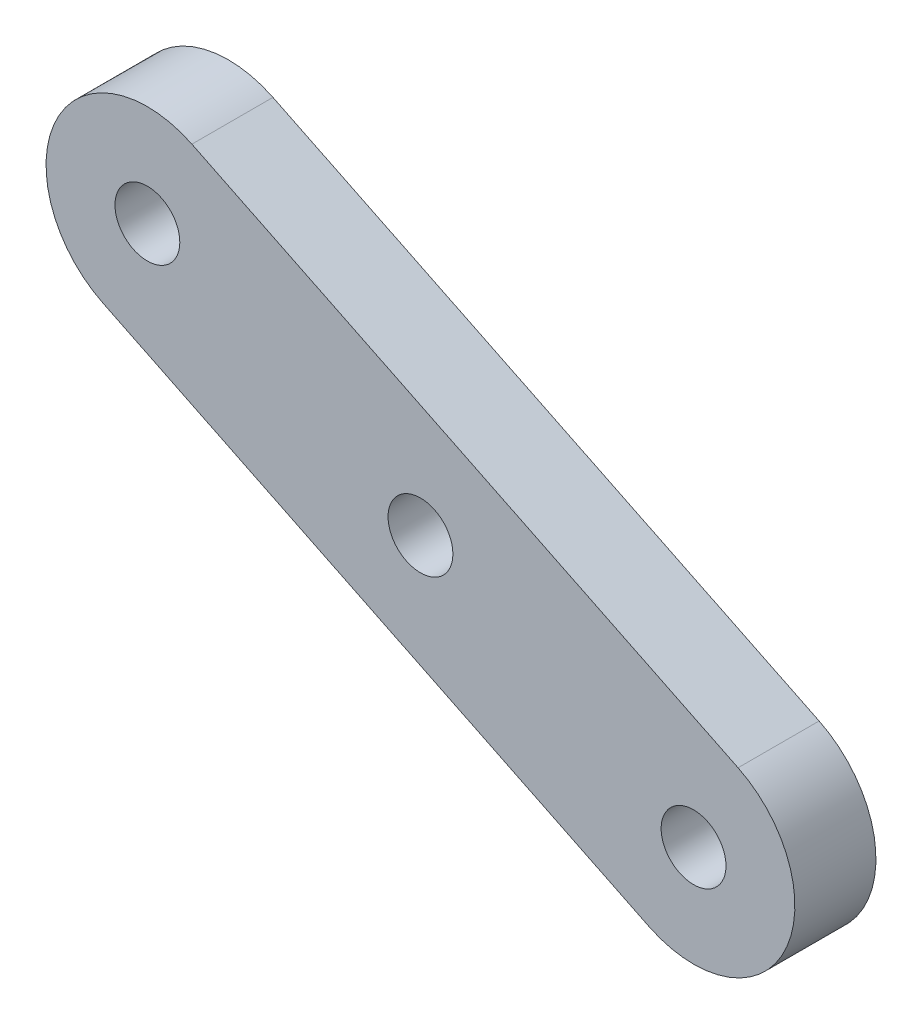
ISO-10303-21;
HEADER;
FILE_DESCRIPTION(('STEP AP214'),'2;1');
FILE_NAME('part.step','',(''),(''),'','','');
FILE_SCHEMA(('AUTOMOTIVE_DESIGN { 1 0 10303 214 1 1 1 1 }'));
ENDSEC;
DATA;
#1=APPLICATION_CONTEXT('core data for automotive mechanical design processes');
#2=APPLICATION_PROTOCOL_DEFINITION('international standard','automotive_design',2000,#1);
#3=PRODUCT_CONTEXT('',#1,'mechanical');
#4=PRODUCT('Part','Part','',(#3));
#5=PRODUCT_RELATED_PRODUCT_CATEGORY('part','',(#4));
#6=PRODUCT_DEFINITION_FORMATION('','',#4);
#7=PRODUCT_DEFINITION_CONTEXT('part definition',#1,'design');
#8=PRODUCT_DEFINITION('design','',#6,#7);
#9=PRODUCT_DEFINITION_SHAPE('','',#8);
#10=(LENGTH_UNIT() NAMED_UNIT(*) SI_UNIT(.MILLI.,.METRE.));
#11=(NAMED_UNIT(*) PLANE_ANGLE_UNIT() SI_UNIT($,.RADIAN.));
#12=(NAMED_UNIT(*) SI_UNIT($,.STERADIAN.) SOLID_ANGLE_UNIT());
#13=UNCERTAINTY_MEASURE_WITH_UNIT(LENGTH_MEASURE(1.E-05),#10,'distance_accuracy_value','');
#14=(GEOMETRIC_REPRESENTATION_CONTEXT(3) GLOBAL_UNCERTAINTY_ASSIGNED_CONTEXT((#13)) GLOBAL_UNIT_ASSIGNED_CONTEXT((#10,
#11,#12)) REPRESENTATION_CONTEXT('',''));
#15=CARTESIAN_POINT('',(0.,0.,0.));
#16=DIRECTION('',(0.,0.,1.));
#17=DIRECTION('',(1.,0.,0.));
#18=AXIS2_PLACEMENT_3D('',#15,#16,#17);
#19=CARTESIAN_POINT('',(0.,0.,4.));
#20=DIRECTION('',(0.,0.,1.));
#21=DIRECTION('',(1.,0.,0.));
#22=AXIS2_PLACEMENT_3D('',#19,#20,#21);
#23=PLANE('',#22);
#24=CARTESIAN_POINT('',(0.,0.,4.));
#25=DIRECTION('',(0.,0.,1.));
#26=DIRECTION('',(1.,0.,0.));
#27=AXIS2_PLACEMENT_3D('',#24,#25,#26);
#28=CIRCLE('',#27,1.6);
#29=CARTESIAN_POINT('',(1.60000000000001,0.,4.));
#30=VERTEX_POINT('',#29);
#31=EDGE_CURVE('E115',#30,#30,#28,.T.);
#32=ORIENTED_EDGE('',*,*,#31,.F.);
#33=EDGE_LOOP('',(#32));
#34=FACE_BOUND('',#33,.T.);
#35=CARTESIAN_POINT('',(0.,0.,4.));
#36=DIRECTION('',(0.,0.,1.));
#37=DIRECTION('',(1.,0.,0.));
#38=AXIS2_PLACEMENT_3D('',#35,#36,#37);
#39=CIRCLE('',#38,5.);
#40=CARTESIAN_POINT('',(-2.19568936266241,-4.4920984208598,4.));
#41=VERTEX_POINT('',#40);
#42=CARTESIAN_POINT('',(2.19568936266242,4.4920984208598,4.));
#43=VERTEX_POINT('',#42);
#44=EDGE_CURVE('E85',#41,#43,#39,.T.);
#45=ORIENTED_EDGE('',*,*,#44,.T.);
#46=DIRECTION('',(-0.89841968417196,0.439137872532483,0.));
#47=VECTOR('',#46,1.);
#48=CARTESIAN_POINT('',(2.19568936266242,4.4920984208598,4.));
#49=LINE('',#48,#47);
#50=CARTESIAN_POINT('',(-24.7569011624964,17.6662345968343,4.));
#51=VERTEX_POINT('',#50);
#52=EDGE_CURVE('E80',#43,#51,#49,.T.);
#53=ORIENTED_EDGE('',*,*,#52,.T.);
#54=CARTESIAN_POINT('',(-26.9525905251588,13.1741361759745,4.));
#55=DIRECTION('',(0.,0.,1.));
#56=DIRECTION('',(1.,0.,0.));
#57=AXIS2_PLACEMENT_3D('',#54,#55,#56);
#58=CIRCLE('',#57,5.);
#59=CARTESIAN_POINT('',(-29.1482798878212,8.68203775511467,4.));
#60=VERTEX_POINT('',#59);
#61=EDGE_CURVE('E83',#51,#60,#58,.T.);
#62=ORIENTED_EDGE('',*,*,#61,.T.);
#63=DIRECTION('',(0.89841968417196,-0.439137872532482,0.));
#64=VECTOR('',#63,1.);
#65=CARTESIAN_POINT('',(-2.19568936266241,-4.4920984208598,4.));
#66=LINE('',#65,#64);
#67=EDGE_CURVE('E50',#60,#41,#66,.T.);
#68=ORIENTED_EDGE('',*,*,#67,.T.);
#69=EDGE_LOOP('',(#45,#53,#62,#68));
#70=FACE_BOUND('',#69,.T.);
#71=CARTESIAN_POINT('',(-26.9525905251588,13.1741361759745,4.));
#72=DIRECTION('',(0.,0.,1.));
#73=DIRECTION('',(1.,0.,0.));
#74=AXIS2_PLACEMENT_3D('',#71,#72,#73);
#75=CIRCLE('',#74,1.6);
#76=CARTESIAN_POINT('',(-25.3525905251588,13.1741361759745,4.));
#77=VERTEX_POINT('',#76);
#78=EDGE_CURVE('E100',#77,#77,#75,.T.);
#79=ORIENTED_EDGE('',*,*,#78,.F.);
#80=EDGE_LOOP('',(#79));
#81=FACE_BOUND('',#80,.T.);
#82=CARTESIAN_POINT('',(-13.4762952625794,6.58706808798724,4.));
#83=DIRECTION('',(0.,0.,1.));
#84=DIRECTION('',(1.,0.,0.));
#85=AXIS2_PLACEMENT_3D('',#82,#83,#84);
#86=CIRCLE('',#85,1.6);
#87=CARTESIAN_POINT('',(-11.8762952625794,6.58706808798724,4.));
#88=VERTEX_POINT('',#87);
#89=EDGE_CURVE('E121',#88,#88,#86,.T.);
#90=ORIENTED_EDGE('',*,*,#89,.F.);
#91=EDGE_LOOP('',(#90));
#92=FACE_BOUND('',#91,.T.);
#93=ADVANCED_FACE('F33',(#34,#70,#81,#92),#23,.T.);
#94=CARTESIAN_POINT('',(0.,0.,0.));
#95=DIRECTION('',(0.,0.,1.));
#96=DIRECTION('',(1.,0.,0.));
#97=AXIS2_PLACEMENT_3D('',#94,#95,#96);
#98=PLANE('',#97);
#99=CARTESIAN_POINT('',(0.,0.,0.));
#100=DIRECTION('',(0.,0.,1.));
#101=DIRECTION('',(1.,0.,0.));
#102=AXIS2_PLACEMENT_3D('',#99,#100,#101);
#103=CIRCLE('',#102,5.);
#104=CARTESIAN_POINT('',(-2.19568936266241,-4.4920984208598,0.));
#105=VERTEX_POINT('',#104);
#106=CARTESIAN_POINT('',(2.19568936266242,4.4920984208598,0.));
#107=VERTEX_POINT('',#106);
#108=EDGE_CURVE('E97',#105,#107,#103,.T.);
#109=ORIENTED_EDGE('',*,*,#108,.F.);
#110=DIRECTION('',(0.89841968417196,-0.439137872532482,0.));
#111=VECTOR('',#110,1.);
#112=CARTESIAN_POINT('',(-2.19568936266241,-4.4920984208598,0.));
#113=LINE('',#112,#111);
#114=CARTESIAN_POINT('',(-29.1482798878212,8.68203775511467,0.));
#115=VERTEX_POINT('',#114);
#116=EDGE_CURVE('E73',#115,#105,#113,.T.);
#117=ORIENTED_EDGE('',*,*,#116,.F.);
#118=CARTESIAN_POINT('',(-26.9525905251588,13.1741361759745,0.));
#119=DIRECTION('',(0.,0.,1.));
#120=DIRECTION('',(1.,0.,0.));
#121=AXIS2_PLACEMENT_3D('',#118,#119,#120);
#122=CIRCLE('',#121,5.);
#123=CARTESIAN_POINT('',(-24.7569011624964,17.6662345968343,0.));
#124=VERTEX_POINT('',#123);
#125=EDGE_CURVE('E67',#124,#115,#122,.T.);
#126=ORIENTED_EDGE('',*,*,#125,.F.);
#127=DIRECTION('',(-0.89841968417196,0.439137872532483,0.));
#128=VECTOR('',#127,1.);
#129=CARTESIAN_POINT('',(2.19568936266242,4.4920984208598,0.));
#130=LINE('',#129,#128);
#131=EDGE_CURVE('E89',#107,#124,#130,.T.);
#132=ORIENTED_EDGE('',*,*,#131,.F.);
#133=EDGE_LOOP('',(#109,#117,#126,#132));
#134=FACE_BOUND('',#133,.T.);
#135=CARTESIAN_POINT('',(-26.9525905251588,13.1741361759745,0.));
#136=DIRECTION('',(0.,0.,1.));
#137=DIRECTION('',(1.,0.,0.));
#138=AXIS2_PLACEMENT_3D('',#135,#136,#137);
#139=CIRCLE('',#138,1.6);
#140=CARTESIAN_POINT('',(-25.3525905251588,13.1741361759745,0.));
#141=VERTEX_POINT('',#140);
#142=EDGE_CURVE('E112',#141,#141,#139,.T.);
#143=ORIENTED_EDGE('',*,*,#142,.T.);
#144=EDGE_LOOP('',(#143));
#145=FACE_BOUND('',#144,.T.);
#146=CARTESIAN_POINT('',(0.,0.,0.));
#147=DIRECTION('',(0.,0.,1.));
#148=DIRECTION('',(1.,0.,0.));
#149=AXIS2_PLACEMENT_3D('',#146,#147,#148);
#150=CIRCLE('',#149,1.6);
#151=CARTESIAN_POINT('',(1.60000000000001,0.,0.));
#152=VERTEX_POINT('',#151);
#153=EDGE_CURVE('E118',#152,#152,#150,.T.);
#154=ORIENTED_EDGE('',*,*,#153,.T.);
#155=EDGE_LOOP('',(#154));
#156=FACE_BOUND('',#155,.T.);
#157=CARTESIAN_POINT('',(-13.4762952625794,6.58706808798724,0.));
#158=DIRECTION('',(0.,0.,1.));
#159=DIRECTION('',(1.,0.,0.));
#160=AXIS2_PLACEMENT_3D('',#157,#158,#159);
#161=CIRCLE('',#160,1.6);
#162=CARTESIAN_POINT('',(-11.8762952625794,6.58706808798724,0.));
#163=VERTEX_POINT('',#162);
#164=EDGE_CURVE('E124',#163,#163,#161,.T.);
#165=ORIENTED_EDGE('',*,*,#164,.T.);
#166=EDGE_LOOP('',(#165));
#167=FACE_BOUND('',#166,.T.);
#168=ADVANCED_FACE('F108',(#134,#145,#156,#167),#98,.F.);
#169=CARTESIAN_POINT('',(0.,0.,4.));
#170=DIRECTION('',(0.,0.,-1.));
#171=DIRECTION('',(-1.,0.,0.));
#172=AXIS2_PLACEMENT_3D('',#169,#170,#171);
#173=CYLINDRICAL_SURFACE('',#172,5.);
#174=ORIENTED_EDGE('',*,*,#108,.T.);
#175=DIRECTION('',(0.,0.,-1.));
#176=VECTOR('',#175,1.);
#177=CARTESIAN_POINT('',(2.19568936266242,4.4920984208598,4.));
#178=LINE('',#177,#176);
#179=EDGE_CURVE('E11',#43,#107,#178,.T.);
#180=ORIENTED_EDGE('',*,*,#179,.F.);
#181=ORIENTED_EDGE('',*,*,#44,.F.);
#182=DIRECTION('',(0.,0.,-1.));
#183=VECTOR('',#182,1.);
#184=CARTESIAN_POINT('',(-2.19568936266241,-4.4920984208598,4.));
#185=LINE('',#184,#183);
#186=EDGE_CURVE('E93',#41,#105,#185,.T.);
#187=ORIENTED_EDGE('',*,*,#186,.T.);
#188=EDGE_LOOP('',(#174,#180,#181,#187));
#189=FACE_BOUND('',#188,.T.);
#190=ADVANCED_FACE('F35',(#189),#173,.T.);
#191=CARTESIAN_POINT('',(2.19568936266242,4.4920984208598,4.));
#192=DIRECTION('',(-0.439137872532483,-0.89841968417196,0.));
#193=DIRECTION('',(0.89841968417196,-0.439137872532483,0.));
#194=AXIS2_PLACEMENT_3D('',#191,#192,#193);
#195=PLANE('',#194);
#196=ORIENTED_EDGE('',*,*,#131,.T.);
#197=DIRECTION('',(0.,0.,-1.));
#198=VECTOR('',#197,1.);
#199=CARTESIAN_POINT('',(-24.7569011624964,17.6662345968343,4.));
#200=LINE('',#199,#198);
#201=EDGE_CURVE('E42',#51,#124,#200,.T.);
#202=ORIENTED_EDGE('',*,*,#201,.F.);
#203=ORIENTED_EDGE('',*,*,#52,.F.);
#204=ORIENTED_EDGE('',*,*,#179,.T.);
#205=EDGE_LOOP('',(#196,#202,#203,#204));
#206=FACE_BOUND('',#205,.T.);
#207=ADVANCED_FACE('F88',(#206),#195,.F.);
#208=CARTESIAN_POINT('',(-26.9525905251588,13.1741361759745,4.));
#209=DIRECTION('',(0.,0.,-1.));
#210=DIRECTION('',(-1.,0.,0.));
#211=AXIS2_PLACEMENT_3D('',#208,#209,#210);
#212=CYLINDRICAL_SURFACE('',#211,5.);
#213=ORIENTED_EDGE('',*,*,#125,.T.);
#214=DIRECTION('',(0.,0.,-1.));
#215=VECTOR('',#214,1.);
#216=CARTESIAN_POINT('',(-29.1482798878212,8.68203775511467,4.));
#217=LINE('',#216,#215);
#218=EDGE_CURVE('E90',#60,#115,#217,.T.);
#219=ORIENTED_EDGE('',*,*,#218,.F.);
#220=ORIENTED_EDGE('',*,*,#61,.F.);
#221=ORIENTED_EDGE('',*,*,#201,.T.);
#222=EDGE_LOOP('',(#213,#219,#220,#221));
#223=FACE_BOUND('',#222,.T.);
#224=ADVANCED_FACE('F91',(#223),#212,.T.);
#225=CARTESIAN_POINT('',(-2.19568936266241,-4.4920984208598,4.));
#226=DIRECTION('',(0.439137872532482,0.89841968417196,0.));
#227=DIRECTION('',(-0.89841968417196,0.439137872532482,0.));
#228=AXIS2_PLACEMENT_3D('',#225,#226,#227);
#229=PLANE('',#228);
#230=ORIENTED_EDGE('',*,*,#116,.T.);
#231=ORIENTED_EDGE('',*,*,#186,.F.);
#232=ORIENTED_EDGE('',*,*,#67,.F.);
#233=ORIENTED_EDGE('',*,*,#218,.T.);
#234=EDGE_LOOP('',(#230,#231,#232,#233));
#235=FACE_BOUND('',#234,.T.);
#236=ADVANCED_FACE('F105',(#235),#229,.F.);
#237=CARTESIAN_POINT('',(-26.9525905251588,13.1741361759745,4.));
#238=DIRECTION('',(0.,0.,-1.));
#239=DIRECTION('',(-1.,0.,0.));
#240=AXIS2_PLACEMENT_3D('',#237,#238,#239);
#241=CYLINDRICAL_SURFACE('',#240,1.6);
#242=ORIENTED_EDGE('',*,*,#78,.T.);
#243=EDGE_LOOP('',(#242));
#244=FACE_BOUND('',#243,.T.);
#245=ORIENTED_EDGE('',*,*,#142,.F.);
#246=EDGE_LOOP('',(#245));
#247=FACE_BOUND('',#246,.T.);
#248=ADVANCED_FACE('F142',(#244,#247),#241,.F.);
#249=CARTESIAN_POINT('',(0.,0.,4.));
#250=DIRECTION('',(0.,0.,-1.));
#251=DIRECTION('',(-1.,0.,0.));
#252=AXIS2_PLACEMENT_3D('',#249,#250,#251);
#253=CYLINDRICAL_SURFACE('',#252,1.6);
#254=ORIENTED_EDGE('',*,*,#31,.T.);
#255=EDGE_LOOP('',(#254));
#256=FACE_BOUND('',#255,.T.);
#257=ORIENTED_EDGE('',*,*,#153,.F.);
#258=EDGE_LOOP('',(#257));
#259=FACE_BOUND('',#258,.T.);
#260=ADVANCED_FACE('F188',(#256,#259),#253,.F.);
#261=CARTESIAN_POINT('',(-13.4762952625794,6.58706808798724,4.));
#262=DIRECTION('',(0.,0.,-1.));
#263=DIRECTION('',(-1.,0.,0.));
#264=AXIS2_PLACEMENT_3D('',#261,#262,#263);
#265=CYLINDRICAL_SURFACE('',#264,1.6);
#266=ORIENTED_EDGE('',*,*,#89,.T.);
#267=EDGE_LOOP('',(#266));
#268=FACE_BOUND('',#267,.T.);
#269=ORIENTED_EDGE('',*,*,#164,.F.);
#270=EDGE_LOOP('',(#269));
#271=FACE_BOUND('',#270,.T.);
#272=ADVANCED_FACE('F130',(#268,#271),#265,.F.);
#273=CLOSED_SHELL('',(#93,#168,#190,#207,#224,#236,#248,#260,#272));
#274=MANIFOLD_SOLID_BREP('B2',#273);
#275=ADVANCED_BREP_SHAPE_REPRESENTATION('',(#18,#274),#14);
#276=SHAPE_DEFINITION_REPRESENTATION(#9,#275);
ENDSEC;
END-ISO-10303-21;
